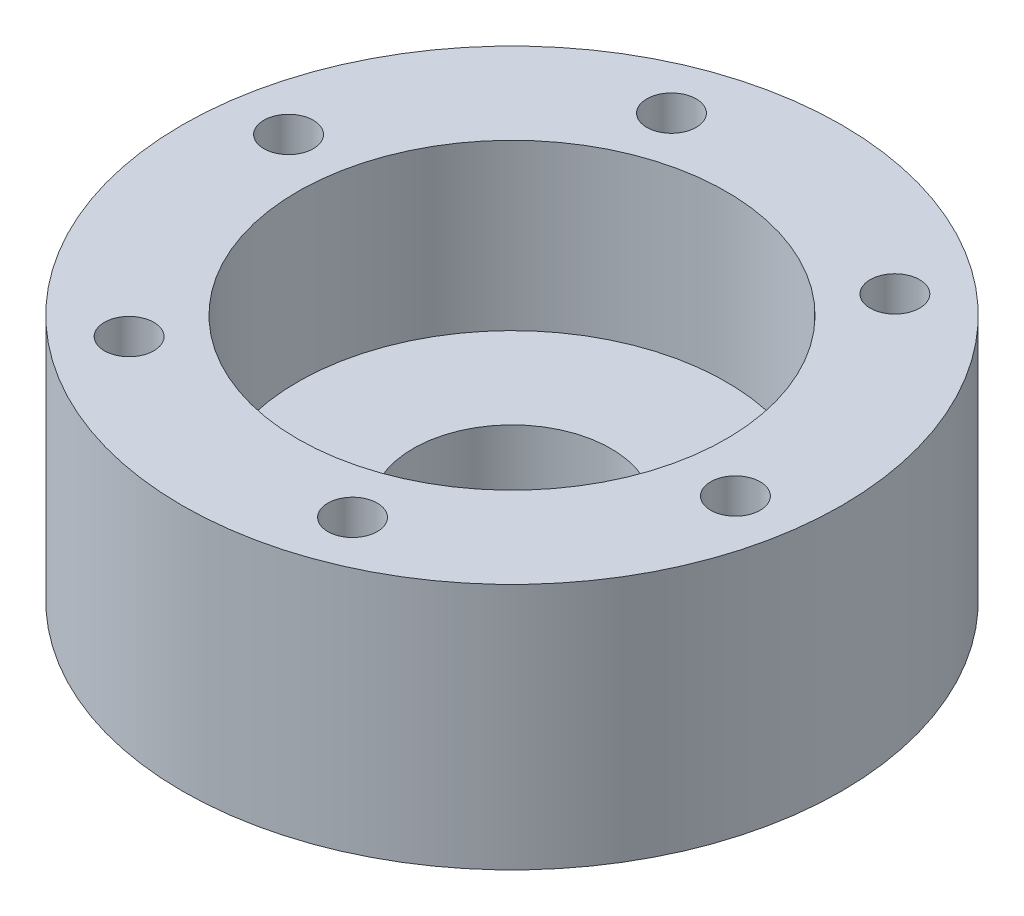
ISO-10303-21;
HEADER;
FILE_DESCRIPTION(('STEP AP214'),'2;1');
FILE_NAME('part.step','',(''),(''),'','','');
FILE_SCHEMA(('AUTOMOTIVE_DESIGN { 1 0 10303 214 1 1 1 1 }'));
ENDSEC;
DATA;
#1=APPLICATION_CONTEXT('core data for automotive mechanical design processes');
#2=APPLICATION_PROTOCOL_DEFINITION('international standard','automotive_design',2000,#1);
#3=PRODUCT_CONTEXT('',#1,'mechanical');
#4=PRODUCT('Part','Part','',(#3));
#5=PRODUCT_RELATED_PRODUCT_CATEGORY('part','',(#4));
#6=PRODUCT_DEFINITION_FORMATION('','',#4);
#7=PRODUCT_DEFINITION_CONTEXT('part definition',#1,'design');
#8=PRODUCT_DEFINITION('design','',#6,#7);
#9=PRODUCT_DEFINITION_SHAPE('','',#8);
#10=(LENGTH_UNIT() NAMED_UNIT(*) SI_UNIT(.MILLI.,.METRE.));
#11=(NAMED_UNIT(*) PLANE_ANGLE_UNIT() SI_UNIT($,.RADIAN.));
#12=(NAMED_UNIT(*) SI_UNIT($,.STERADIAN.) SOLID_ANGLE_UNIT());
#13=UNCERTAINTY_MEASURE_WITH_UNIT(LENGTH_MEASURE(1.E-05),#10,'distance_accuracy_value','');
#14=(GEOMETRIC_REPRESENTATION_CONTEXT(3) GLOBAL_UNCERTAINTY_ASSIGNED_CONTEXT((#13)) GLOBAL_UNIT_ASSIGNED_CONTEXT((#10,
#11,#12)) REPRESENTATION_CONTEXT('',''));
#15=CARTESIAN_POINT('',(0.,0.,0.));
#16=DIRECTION('',(0.,0.,1.));
#17=DIRECTION('',(1.,0.,0.));
#18=AXIS2_PLACEMENT_3D('',#15,#16,#17);
#19=CARTESIAN_POINT('',(0.,15.,0.));
#20=DIRECTION('',(0.,-1.,0.));
#21=DIRECTION('',(0.,0.,-1.));
#22=AXIS2_PLACEMENT_3D('',#19,#20,#21);
#23=CYLINDRICAL_SURFACE('',#22,20.);
#24=CARTESIAN_POINT('',(0.,15.,0.));
#25=DIRECTION('',(0.,1.,0.));
#26=DIRECTION('',(0.,0.,1.));
#27=AXIS2_PLACEMENT_3D('',#24,#25,#26);
#28=CIRCLE('',#27,20.);
#29=CARTESIAN_POINT('',(0.,15.,20.));
#30=VERTEX_POINT('',#29);
#31=EDGE_CURVE('E10',#30,#30,#28,.T.);
#32=ORIENTED_EDGE('',*,*,#31,.F.);
#33=EDGE_LOOP('',(#32));
#34=FACE_BOUND('',#33,.T.);
#35=CARTESIAN_POINT('',(0.,0.,0.));
#36=DIRECTION('',(0.,1.,0.));
#37=DIRECTION('',(0.,0.,1.));
#38=AXIS2_PLACEMENT_3D('',#35,#36,#37);
#39=CIRCLE('',#38,20.);
#40=CARTESIAN_POINT('',(0.,0.,20.));
#41=VERTEX_POINT('',#40);
#42=EDGE_CURVE('E34',#41,#41,#39,.T.);
#43=ORIENTED_EDGE('',*,*,#42,.T.);
#44=EDGE_LOOP('',(#43));
#45=FACE_BOUND('',#44,.T.);
#46=ADVANCED_FACE('F31',(#34,#45),#23,.T.);
#47=CARTESIAN_POINT('',(0.,15.,0.));
#48=DIRECTION('',(0.,1.,0.));
#49=DIRECTION('',(0.,0.,1.));
#50=AXIS2_PLACEMENT_3D('',#47,#48,#49);
#51=PLANE('',#50);
#52=CARTESIAN_POINT('',(5.78104182663744,15.,15.4541112781896));
#53=DIRECTION('',(0.,1.,0.));
#54=DIRECTION('',(0.,0.,1.));
#55=AXIS2_PLACEMENT_3D('',#52,#53,#54);
#56=CIRCLE('',#55,1.5);
#57=CARTESIAN_POINT('',(5.78104182663744,15.,16.9541112781896));
#58=VERTEX_POINT('',#57);
#59=EDGE_CURVE('E85',#58,#58,#56,.T.);
#60=ORIENTED_EDGE('',*,*,#59,.F.);
#61=EDGE_LOOP('',(#60));
#62=FACE_BOUND('',#61,.T.);
#63=CARTESIAN_POINT('',(16.2741738731426,15.,2.72052655688637));
#64=DIRECTION('',(0.,1.,0.));
#65=DIRECTION('',(0.,0.,1.));
#66=AXIS2_PLACEMENT_3D('',#63,#64,#65);
#67=CIRCLE('',#66,1.5);
#68=CARTESIAN_POINT('',(16.2741738731426,15.,4.22052655688636));
#69=VERTEX_POINT('',#68);
#70=EDGE_CURVE('E79',#69,#69,#67,.T.);
#71=ORIENTED_EDGE('',*,*,#70,.F.);
#72=EDGE_LOOP('',(#71));
#73=FACE_BOUND('',#72,.T.);
#74=CARTESIAN_POINT('',(10.4931320465051,15.,-12.7335847213033));
#75=DIRECTION('',(0.,1.,0.));
#76=DIRECTION('',(0.,0.,1.));
#77=AXIS2_PLACEMENT_3D('',#74,#75,#76);
#78=CIRCLE('',#77,1.5);
#79=CARTESIAN_POINT('',(10.4931320465051,15.,-11.2335847213033));
#80=VERTEX_POINT('',#79);
#81=EDGE_CURVE('E73',#80,#80,#78,.T.);
#82=ORIENTED_EDGE('',*,*,#81,.F.);
#83=EDGE_LOOP('',(#82));
#84=FACE_BOUND('',#83,.T.);
#85=CARTESIAN_POINT('',(-5.78104182663755,15.,-15.4541112781896));
#86=DIRECTION('',(0.,1.,0.));
#87=DIRECTION('',(0.,0.,1.));
#88=AXIS2_PLACEMENT_3D('',#85,#86,#87);
#89=CIRCLE('',#88,1.5);
#90=CARTESIAN_POINT('',(-5.78104182663755,15.,-13.9541112781896));
#91=VERTEX_POINT('',#90);
#92=EDGE_CURVE('E67',#91,#91,#89,.T.);
#93=ORIENTED_EDGE('',*,*,#92,.F.);
#94=EDGE_LOOP('',(#93));
#95=FACE_BOUND('',#94,.T.);
#96=CARTESIAN_POINT('',(-16.2741738731426,15.,-2.72052655688625));
#97=DIRECTION('',(0.,1.,0.));
#98=DIRECTION('',(0.,0.,1.));
#99=AXIS2_PLACEMENT_3D('',#96,#97,#98);
#100=CIRCLE('',#99,1.5);
#101=CARTESIAN_POINT('',(-16.2741738731426,15.,-1.22052655688626));
#102=VERTEX_POINT('',#101);
#103=EDGE_CURVE('E61',#102,#102,#100,.T.);
#104=ORIENTED_EDGE('',*,*,#103,.F.);
#105=EDGE_LOOP('',(#104));
#106=FACE_BOUND('',#105,.T.);
#107=CARTESIAN_POINT('',(-10.493132046505,15.,12.7335847213034));
#108=DIRECTION('',(0.,1.,0.));
#109=DIRECTION('',(0.,0.,1.));
#110=AXIS2_PLACEMENT_3D('',#107,#108,#109);
#111=CIRCLE('',#110,1.5);
#112=CARTESIAN_POINT('',(-10.493132046505,15.,14.2335847213034));
#113=VERTEX_POINT('',#112);
#114=EDGE_CURVE('E55',#113,#113,#111,.T.);
#115=ORIENTED_EDGE('',*,*,#114,.F.);
#116=EDGE_LOOP('',(#115));
#117=FACE_BOUND('',#116,.T.);
#118=CARTESIAN_POINT('',(0.,15.,0.));
#119=DIRECTION('',(0.,1.,0.));
#120=DIRECTION('',(0.,0.,1.));
#121=AXIS2_PLACEMENT_3D('',#118,#119,#120);
#122=CIRCLE('',#121,13.);
#123=CARTESIAN_POINT('',(0.,15.,13.));
#124=VERTEX_POINT('',#123);
#125=EDGE_CURVE('E43',#124,#124,#122,.T.);
#126=ORIENTED_EDGE('',*,*,#125,.F.);
#127=EDGE_LOOP('',(#126));
#128=FACE_BOUND('',#127,.T.);
#129=ORIENTED_EDGE('',*,*,#31,.T.);
#130=EDGE_LOOP('',(#129));
#131=FACE_BOUND('',#130,.T.);
#132=ADVANCED_FACE('F101',(#62,#73,#84,#95,#106,#117,#128,#131),#51,.T.);
#133=CARTESIAN_POINT('',(0.,0.,0.));
#134=DIRECTION('',(0.,1.,0.));
#135=DIRECTION('',(0.,0.,1.));
#136=AXIS2_PLACEMENT_3D('',#133,#134,#135);
#137=PLANE('',#136);
#138=CARTESIAN_POINT('',(5.78104182663744,0.,15.4541112781896));
#139=DIRECTION('',(0.,1.,0.));
#140=DIRECTION('',(0.,0.,1.));
#141=AXIS2_PLACEMENT_3D('',#138,#139,#140);
#142=CIRCLE('',#141,1.5);
#143=CARTESIAN_POINT('',(5.78104182663744,0.,16.9541112781896));
#144=VERTEX_POINT('',#143);
#145=EDGE_CURVE('E82',#144,#144,#142,.T.);
#146=ORIENTED_EDGE('',*,*,#145,.T.);
#147=EDGE_LOOP('',(#146));
#148=FACE_BOUND('',#147,.T.);
#149=CARTESIAN_POINT('',(16.2741738731426,0.,2.72052655688637));
#150=DIRECTION('',(0.,1.,0.));
#151=DIRECTION('',(0.,0.,1.));
#152=AXIS2_PLACEMENT_3D('',#149,#150,#151);
#153=CIRCLE('',#152,1.5);
#154=CARTESIAN_POINT('',(16.2741738731426,0.,4.22052655688636));
#155=VERTEX_POINT('',#154);
#156=EDGE_CURVE('E76',#155,#155,#153,.T.);
#157=ORIENTED_EDGE('',*,*,#156,.T.);
#158=EDGE_LOOP('',(#157));
#159=FACE_BOUND('',#158,.T.);
#160=CARTESIAN_POINT('',(10.4931320465051,0.,-12.7335847213033));
#161=DIRECTION('',(0.,1.,0.));
#162=DIRECTION('',(0.,0.,1.));
#163=AXIS2_PLACEMENT_3D('',#160,#161,#162);
#164=CIRCLE('',#163,1.5);
#165=CARTESIAN_POINT('',(10.4931320465051,0.,-11.2335847213033));
#166=VERTEX_POINT('',#165);
#167=EDGE_CURVE('E70',#166,#166,#164,.T.);
#168=ORIENTED_EDGE('',*,*,#167,.T.);
#169=EDGE_LOOP('',(#168));
#170=FACE_BOUND('',#169,.T.);
#171=CARTESIAN_POINT('',(-5.78104182663755,0.,-15.4541112781896));
#172=DIRECTION('',(0.,1.,0.));
#173=DIRECTION('',(0.,0.,1.));
#174=AXIS2_PLACEMENT_3D('',#171,#172,#173);
#175=CIRCLE('',#174,1.5);
#176=CARTESIAN_POINT('',(-5.78104182663755,0.,-13.9541112781896));
#177=VERTEX_POINT('',#176);
#178=EDGE_CURVE('E64',#177,#177,#175,.T.);
#179=ORIENTED_EDGE('',*,*,#178,.T.);
#180=EDGE_LOOP('',(#179));
#181=FACE_BOUND('',#180,.T.);
#182=CARTESIAN_POINT('',(-16.2741738731426,0.,-2.72052655688625));
#183=DIRECTION('',(0.,1.,0.));
#184=DIRECTION('',(0.,0.,1.));
#185=AXIS2_PLACEMENT_3D('',#182,#183,#184);
#186=CIRCLE('',#185,1.5);
#187=CARTESIAN_POINT('',(-16.2741738731426,0.,-1.22052655688626));
#188=VERTEX_POINT('',#187);
#189=EDGE_CURVE('E58',#188,#188,#186,.T.);
#190=ORIENTED_EDGE('',*,*,#189,.T.);
#191=EDGE_LOOP('',(#190));
#192=FACE_BOUND('',#191,.T.);
#193=CARTESIAN_POINT('',(-10.493132046505,0.,12.7335847213034));
#194=DIRECTION('',(0.,1.,0.));
#195=DIRECTION('',(0.,0.,1.));
#196=AXIS2_PLACEMENT_3D('',#193,#194,#195);
#197=CIRCLE('',#196,1.5);
#198=CARTESIAN_POINT('',(-10.493132046505,0.,14.2335847213034));
#199=VERTEX_POINT('',#198);
#200=EDGE_CURVE('E52',#199,#199,#197,.T.);
#201=ORIENTED_EDGE('',*,*,#200,.T.);
#202=EDGE_LOOP('',(#201));
#203=FACE_BOUND('',#202,.T.);
#204=CARTESIAN_POINT('',(0.,0.,0.));
#205=DIRECTION('',(0.,1.,0.));
#206=DIRECTION('',(0.,0.,1.));
#207=AXIS2_PLACEMENT_3D('',#204,#205,#206);
#208=CIRCLE('',#207,6.);
#209=CARTESIAN_POINT('',(0.,0.,6.));
#210=VERTEX_POINT('',#209);
#211=EDGE_CURVE('E46',#210,#210,#208,.T.);
#212=ORIENTED_EDGE('',*,*,#211,.T.);
#213=EDGE_LOOP('',(#212));
#214=FACE_BOUND('',#213,.T.);
#215=ORIENTED_EDGE('',*,*,#42,.F.);
#216=EDGE_LOOP('',(#215));
#217=FACE_BOUND('',#216,.T.);
#218=ADVANCED_FACE('F91',(#148,#159,#170,#181,#192,#203,#214,#217),#137,.F.);
#219=CARTESIAN_POINT('',(0.,5.,0.));
#220=DIRECTION('',(0.,1.,0.));
#221=DIRECTION('',(0.,0.,1.));
#222=AXIS2_PLACEMENT_3D('',#219,#220,#221);
#223=CYLINDRICAL_SURFACE('',#222,13.);
#224=CARTESIAN_POINT('',(0.,5.,0.));
#225=DIRECTION('',(0.,1.,0.));
#226=DIRECTION('',(0.,0.,1.));
#227=AXIS2_PLACEMENT_3D('',#224,#225,#226);
#228=CIRCLE('',#227,13.);
#229=CARTESIAN_POINT('',(0.,5.,13.));
#230=VERTEX_POINT('',#229);
#231=EDGE_CURVE('E41',#230,#230,#228,.T.);
#232=ORIENTED_EDGE('',*,*,#231,.F.);
#233=EDGE_LOOP('',(#232));
#234=FACE_BOUND('',#233,.T.);
#235=ORIENTED_EDGE('',*,*,#125,.T.);
#236=EDGE_LOOP('',(#235));
#237=FACE_BOUND('',#236,.T.);
#238=ADVANCED_FACE('F117',(#234,#237),#223,.F.);
#239=CARTESIAN_POINT('',(0.,5.,0.));
#240=DIRECTION('',(0.,1.,0.));
#241=DIRECTION('',(0.,0.,1.));
#242=AXIS2_PLACEMENT_3D('',#239,#240,#241);
#243=PLANE('',#242);
#244=CARTESIAN_POINT('',(0.,5.,0.));
#245=DIRECTION('',(0.,1.,0.));
#246=DIRECTION('',(0.,0.,1.));
#247=AXIS2_PLACEMENT_3D('',#244,#245,#246);
#248=CIRCLE('',#247,6.);
#249=CARTESIAN_POINT('',(0.,5.,6.));
#250=VERTEX_POINT('',#249);
#251=EDGE_CURVE('E49',#250,#250,#248,.T.);
#252=ORIENTED_EDGE('',*,*,#251,.F.);
#253=EDGE_LOOP('',(#252));
#254=FACE_BOUND('',#253,.T.);
#255=ORIENTED_EDGE('',*,*,#231,.T.);
#256=EDGE_LOOP('',(#255));
#257=FACE_BOUND('',#256,.T.);
#258=ADVANCED_FACE('F119',(#254,#257),#243,.T.);
#259=CARTESIAN_POINT('',(0.,0.,0.));
#260=DIRECTION('',(0.,1.,0.));
#261=DIRECTION('',(0.,0.,1.));
#262=AXIS2_PLACEMENT_3D('',#259,#260,#261);
#263=CYLINDRICAL_SURFACE('',#262,6.);
#264=ORIENTED_EDGE('',*,*,#211,.F.);
#265=EDGE_LOOP('',(#264));
#266=FACE_BOUND('',#265,.T.);
#267=ORIENTED_EDGE('',*,*,#251,.T.);
#268=EDGE_LOOP('',(#267));
#269=FACE_BOUND('',#268,.T.);
#270=ADVANCED_FACE('F126',(#266,#269),#263,.F.);
#271=CARTESIAN_POINT('',(-10.493132046505,0.,12.7335847213034));
#272=DIRECTION('',(0.,1.,0.));
#273=DIRECTION('',(0.,0.,1.));
#274=AXIS2_PLACEMENT_3D('',#271,#272,#273);
#275=CYLINDRICAL_SURFACE('',#274,1.5);
#276=ORIENTED_EDGE('',*,*,#200,.F.);
#277=EDGE_LOOP('',(#276));
#278=FACE_BOUND('',#277,.T.);
#279=ORIENTED_EDGE('',*,*,#114,.T.);
#280=EDGE_LOOP('',(#279));
#281=FACE_BOUND('',#280,.T.);
#282=ADVANCED_FACE('F152',(#278,#281),#275,.F.);
#283=CARTESIAN_POINT('',(-16.2741738731426,0.,-2.72052655688625));
#284=DIRECTION('',(0.,1.,0.));
#285=DIRECTION('',(0.,0.,1.));
#286=AXIS2_PLACEMENT_3D('',#283,#284,#285);
#287=CYLINDRICAL_SURFACE('',#286,1.5);
#288=ORIENTED_EDGE('',*,*,#189,.F.);
#289=EDGE_LOOP('',(#288));
#290=FACE_BOUND('',#289,.T.);
#291=ORIENTED_EDGE('',*,*,#103,.T.);
#292=EDGE_LOOP('',(#291));
#293=FACE_BOUND('',#292,.T.);
#294=ADVANCED_FACE('F157',(#290,#293),#287,.F.);
#295=CARTESIAN_POINT('',(-5.78104182663755,0.,-15.4541112781896));
#296=DIRECTION('',(0.,1.,0.));
#297=DIRECTION('',(0.,0.,1.));
#298=AXIS2_PLACEMENT_3D('',#295,#296,#297);
#299=CYLINDRICAL_SURFACE('',#298,1.5);
#300=ORIENTED_EDGE('',*,*,#178,.F.);
#301=EDGE_LOOP('',(#300));
#302=FACE_BOUND('',#301,.T.);
#303=ORIENTED_EDGE('',*,*,#92,.T.);
#304=EDGE_LOOP('',(#303));
#305=FACE_BOUND('',#304,.T.);
#306=ADVANCED_FACE('F169',(#302,#305),#299,.F.);
#307=CARTESIAN_POINT('',(10.4931320465051,0.,-12.7335847213033));
#308=DIRECTION('',(0.,1.,0.));
#309=DIRECTION('',(0.,0.,1.));
#310=AXIS2_PLACEMENT_3D('',#307,#308,#309);
#311=CYLINDRICAL_SURFACE('',#310,1.5);
#312=ORIENTED_EDGE('',*,*,#167,.F.);
#313=EDGE_LOOP('',(#312));
#314=FACE_BOUND('',#313,.T.);
#315=ORIENTED_EDGE('',*,*,#81,.T.);
#316=EDGE_LOOP('',(#315));
#317=FACE_BOUND('',#316,.T.);
#318=ADVANCED_FACE('F179',(#314,#317),#311,.F.);
#319=CARTESIAN_POINT('',(16.2741738731426,0.,2.72052655688637));
#320=DIRECTION('',(0.,1.,0.));
#321=DIRECTION('',(0.,0.,1.));
#322=AXIS2_PLACEMENT_3D('',#319,#320,#321);
#323=CYLINDRICAL_SURFACE('',#322,1.5);
#324=ORIENTED_EDGE('',*,*,#156,.F.);
#325=EDGE_LOOP('',(#324));
#326=FACE_BOUND('',#325,.T.);
#327=ORIENTED_EDGE('',*,*,#70,.T.);
#328=EDGE_LOOP('',(#327));
#329=FACE_BOUND('',#328,.T.);
#330=ADVANCED_FACE('F97',(#326,#329),#323,.F.);
#331=CARTESIAN_POINT('',(5.78104182663744,0.,15.4541112781896));
#332=DIRECTION('',(0.,1.,0.));
#333=DIRECTION('',(0.,0.,1.));
#334=AXIS2_PLACEMENT_3D('',#331,#332,#333);
#335=CYLINDRICAL_SURFACE('',#334,1.5);
#336=ORIENTED_EDGE('',*,*,#145,.F.);
#337=EDGE_LOOP('',(#336));
#338=FACE_BOUND('',#337,.T.);
#339=ORIENTED_EDGE('',*,*,#59,.T.);
#340=EDGE_LOOP('',(#339));
#341=FACE_BOUND('',#340,.T.);
#342=ADVANCED_FACE('F94',(#338,#341),#335,.F.);
#343=CLOSED_SHELL('',(#46,#132,#218,#238,#258,#270,#282,#294,#306,#318,#330,#342));
#344=MANIFOLD_SOLID_BREP('B2',#343);
#345=ADVANCED_BREP_SHAPE_REPRESENTATION('',(#18,#344),#14);
#346=SHAPE_DEFINITION_REPRESENTATION(#9,#345);
ENDSEC;
END-ISO-10303-21;
